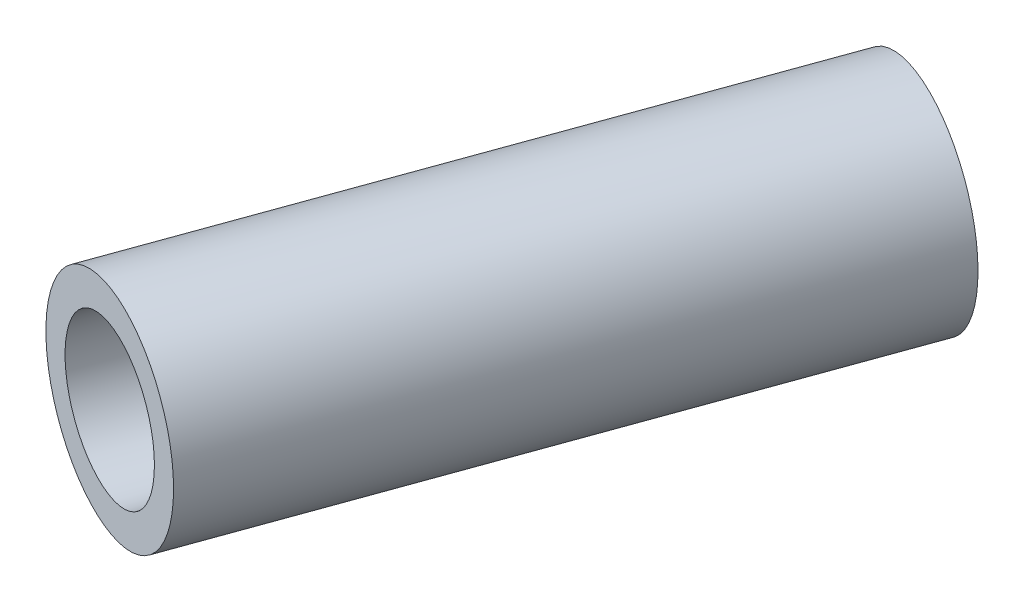
ISO-10303-21;
HEADER;
FILE_DESCRIPTION(('STEP AP214'),'2;1');
FILE_NAME('part.step','',(''),(''),'','','');
FILE_SCHEMA(('AUTOMOTIVE_DESIGN { 1 0 10303 214 1 1 1 1 }'));
ENDSEC;
DATA;
#1=APPLICATION_CONTEXT('core data for automotive mechanical design processes');
#2=APPLICATION_PROTOCOL_DEFINITION('international standard','automotive_design',2000,#1);
#3=PRODUCT_CONTEXT('',#1,'mechanical');
#4=PRODUCT('Part','Part','',(#3));
#5=PRODUCT_RELATED_PRODUCT_CATEGORY('part','',(#4));
#6=PRODUCT_DEFINITION_FORMATION('','',#4);
#7=PRODUCT_DEFINITION_CONTEXT('part definition',#1,'design');
#8=PRODUCT_DEFINITION('design','',#6,#7);
#9=PRODUCT_DEFINITION_SHAPE('','',#8);
#10=(LENGTH_UNIT() NAMED_UNIT(*) SI_UNIT(.MILLI.,.METRE.));
#11=(NAMED_UNIT(*) PLANE_ANGLE_UNIT() SI_UNIT($,.RADIAN.));
#12=(NAMED_UNIT(*) SI_UNIT($,.STERADIAN.) SOLID_ANGLE_UNIT());
#13=UNCERTAINTY_MEASURE_WITH_UNIT(LENGTH_MEASURE(1.E-05),#10,'distance_accuracy_value','');
#14=(GEOMETRIC_REPRESENTATION_CONTEXT(3) GLOBAL_UNCERTAINTY_ASSIGNED_CONTEXT((#13)) GLOBAL_UNIT_ASSIGNED_CONTEXT((#10,
#11,#12)) REPRESENTATION_CONTEXT('',''));
#15=CARTESIAN_POINT('',(0.,0.,0.));
#16=DIRECTION('',(0.,0.,1.));
#17=DIRECTION('',(1.,0.,0.));
#18=AXIS2_PLACEMENT_3D('',#15,#16,#17);
#19=CARTESIAN_POINT('',(198.104724763325,84.5708124907643,-229.252403272386));
#20=DIRECTION('',(0.34065498940062,0.000648415923502178,-0.940188150187639));
#21=DIRECTION('',(-0.940188347812545,-1.04183014465536E-07,-0.340655061077193));
#22=AXIS2_PLACEMENT_3D('',#19,#20,#21);
#23=PLANE('',#22);
#24=CARTESIAN_POINT('',(198.104724763325,84.5708124907643,-229.252403272386));
#25=DIRECTION('',(-0.340654989400621,-0.000648415923502179,0.940188150187638));
#26=DIRECTION('',(0.940188347812545,1.04183015387876E-07,0.340655061077194));
#27=AXIS2_PLACEMENT_3D('',#24,#25,#26);
#28=CIRCLE('',#27,3.5);
#29=CARTESIAN_POINT('',(201.395383980669,84.5708128554049,-228.060110558616));
#30=VERTEX_POINT('',#29);
#31=EDGE_CURVE('E34',#30,#30,#28,.T.);
#32=ORIENTED_EDGE('',*,*,#31,.F.);
#33=EDGE_LOOP('',(#32));
#34=FACE_BOUND('',#33,.T.);
#35=CARTESIAN_POINT('',(198.104724763325,84.5708124907643,-229.252403272386));
#36=DIRECTION('',(-0.34065498940062,-0.000648415923502178,0.940188150187639));
#37=DIRECTION('',(0.940188347812545,1.04183014993986E-07,0.340655061077193));
#38=AXIS2_PLACEMENT_3D('',#35,#36,#37);
#39=CIRCLE('',#38,5.);
#40=CARTESIAN_POINT('',(202.805666502388,84.5708130116794,-227.549127967001));
#41=VERTEX_POINT('',#40);
#42=EDGE_CURVE('E11',#41,#41,#39,.T.);
#43=ORIENTED_EDGE('',*,*,#42,.T.);
#44=EDGE_LOOP('',(#43));
#45=FACE_BOUND('',#44,.T.);
#46=ADVANCED_FACE('F17',(#34,#45),#23,.F.);
#47=CARTESIAN_POINT('',(208.154046950643,84.5899407605076,-256.987953702922));
#48=DIRECTION('',(0.34065498940062,0.000648415923502178,-0.940188150187639));
#49=DIRECTION('',(-0.940188347812545,-1.04183014465536E-07,-0.340655061077193));
#50=AXIS2_PLACEMENT_3D('',#47,#48,#49);
#51=PLANE('',#50);
#52=CARTESIAN_POINT('',(208.154046950643,84.5899407605076,-256.987953702922));
#53=DIRECTION('',(-0.340654989400621,-0.000648415923502179,0.940188150187638));
#54=DIRECTION('',(0.940188347812545,1.04183015392755E-07,0.340655061077194));
#55=AXIS2_PLACEMENT_3D('',#52,#53,#54);
#56=CIRCLE('',#55,3.5);
#57=CARTESIAN_POINT('',(211.444706167987,84.5899411251482,-255.795660989152));
#58=VERTEX_POINT('',#57);
#59=EDGE_CURVE('E27',#58,#58,#56,.T.);
#60=ORIENTED_EDGE('',*,*,#59,.T.);
#61=EDGE_LOOP('',(#60));
#62=FACE_BOUND('',#61,.T.);
#63=CARTESIAN_POINT('',(208.154046950643,84.5899407605076,-256.987953702922));
#64=DIRECTION('',(-0.34065498940062,-0.000648415923502178,0.940188150187639));
#65=DIRECTION('',(0.940188347812545,1.04183014990923E-07,0.340655061077193));
#66=AXIS2_PLACEMENT_3D('',#63,#64,#65);
#67=CIRCLE('',#66,5.);
#68=CARTESIAN_POINT('',(212.854988689706,84.5899412814227,-255.284678397536));
#69=VERTEX_POINT('',#68);
#70=EDGE_CURVE('E21',#69,#69,#67,.T.);
#71=ORIENTED_EDGE('',*,*,#70,.F.);
#72=EDGE_LOOP('',(#71));
#73=FACE_BOUND('',#72,.T.);
#74=ADVANCED_FACE('F44',(#62,#73),#51,.T.);
#75=CARTESIAN_POINT('',(198.104724763325,84.5708124907643,-229.252403272386));
#76=DIRECTION('',(0.340654989400621,0.000648415923502179,-0.940188150187638));
#77=DIRECTION('',(-0.940188347812545,-1.04183015387853E-07,-0.340655061077194));
#78=AXIS2_PLACEMENT_3D('',#75,#76,#77);
#79=CYLINDRICAL_SURFACE('',#78,3.5);
#80=ORIENTED_EDGE('',*,*,#31,.T.);
#81=EDGE_LOOP('',(#80));
#82=FACE_BOUND('',#81,.T.);
#83=ORIENTED_EDGE('',*,*,#59,.F.);
#84=EDGE_LOOP('',(#83));
#85=FACE_BOUND('',#84,.T.);
#86=ADVANCED_FACE('F50',(#82,#85),#79,.F.);
#87=CARTESIAN_POINT('',(198.104724763325,84.5708124907643,-229.252403272386));
#88=DIRECTION('',(0.340654989400621,0.000648415923502179,-0.940188150187638));
#89=DIRECTION('',(-0.940188347812545,-1.0418301499336E-07,-0.340655061077194));
#90=AXIS2_PLACEMENT_3D('',#87,#88,#89);
#91=CYLINDRICAL_SURFACE('',#90,5.);
#92=ORIENTED_EDGE('',*,*,#42,.F.);
#93=EDGE_LOOP('',(#92));
#94=FACE_BOUND('',#93,.T.);
#95=ORIENTED_EDGE('',*,*,#70,.T.);
#96=EDGE_LOOP('',(#95));
#97=FACE_BOUND('',#96,.T.);
#98=ADVANCED_FACE('F19',(#94,#97),#91,.T.);
#99=CLOSED_SHELL('',(#46,#74,#86,#98));
#100=MANIFOLD_SOLID_BREP('B1',#99);
#101=ADVANCED_BREP_SHAPE_REPRESENTATION('',(#18,#100),#14);
#102=SHAPE_DEFINITION_REPRESENTATION(#9,#101);
ENDSEC;
END-ISO-10303-21;
